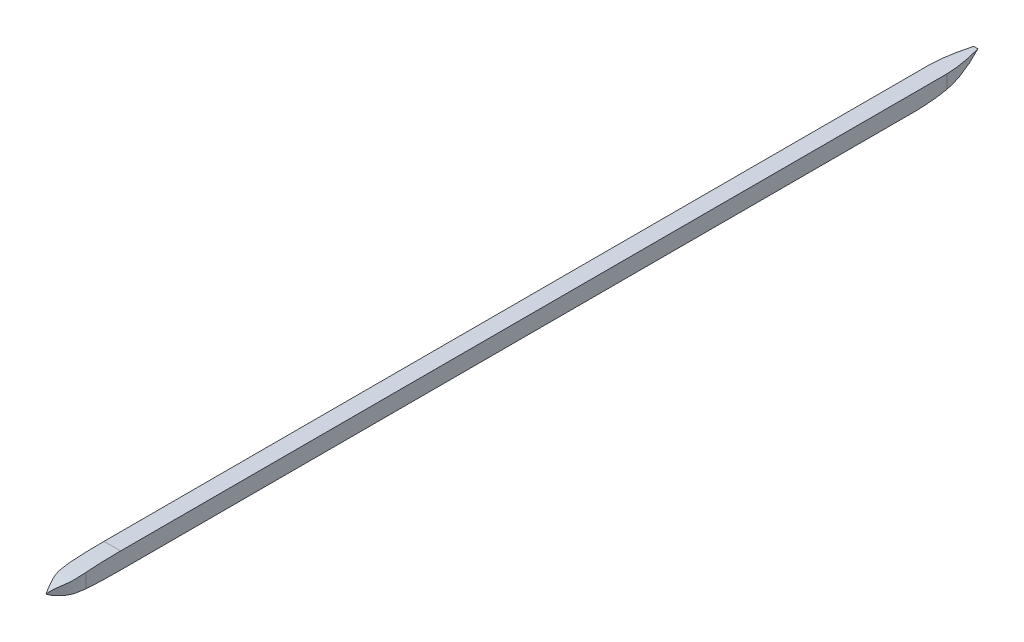
ISO-10303-21;
HEADER;
FILE_DESCRIPTION(('STEP AP214'),'2;1');
FILE_NAME('part.step','',(''),(''),'','','');
FILE_SCHEMA(('AUTOMOTIVE_DESIGN { 1 0 10303 214 1 1 1 1 }'));
ENDSEC;
DATA;
#1=APPLICATION_CONTEXT('core data for automotive mechanical design processes');
#2=APPLICATION_PROTOCOL_DEFINITION('international standard','automotive_design',2000,#1);
#3=PRODUCT_CONTEXT('',#1,'mechanical');
#4=PRODUCT('Part','Part','',(#3));
#5=PRODUCT_RELATED_PRODUCT_CATEGORY('part','',(#4));
#6=PRODUCT_DEFINITION_FORMATION('','',#4);
#7=PRODUCT_DEFINITION_CONTEXT('part definition',#1,'design');
#8=PRODUCT_DEFINITION('design','',#6,#7);
#9=PRODUCT_DEFINITION_SHAPE('','',#8);
#10=(LENGTH_UNIT() NAMED_UNIT(*) SI_UNIT(.MILLI.,.METRE.));
#11=(NAMED_UNIT(*) PLANE_ANGLE_UNIT() SI_UNIT($,.RADIAN.));
#12=(NAMED_UNIT(*) SI_UNIT($,.STERADIAN.) SOLID_ANGLE_UNIT());
#13=UNCERTAINTY_MEASURE_WITH_UNIT(LENGTH_MEASURE(1.E-05),#10,'distance_accuracy_value','');
#14=(GEOMETRIC_REPRESENTATION_CONTEXT(3) GLOBAL_UNCERTAINTY_ASSIGNED_CONTEXT((#13)) GLOBAL_UNIT_ASSIGNED_CONTEXT((#10,
#11,#12)) REPRESENTATION_CONTEXT('',''));
#15=CARTESIAN_POINT('',(0.,0.,0.));
#16=DIRECTION('',(0.,0.,1.));
#17=DIRECTION('',(1.,0.,0.));
#18=AXIS2_PLACEMENT_3D('',#15,#16,#17);
#19=CARTESIAN_POINT('',(6.35,-6.34999999999996,-355.6));
#20=DIRECTION('',(0.,1.,0.));
#21=DIRECTION('',(0.,0.,1.));
#22=AXIS2_PLACEMENT_3D('',#19,#20,#21);
#23=PLANE('',#22);
#24=DIRECTION('',(0.,0.,-1.));
#25=VECTOR('',#24,1.);
#26=CARTESIAN_POINT('',(-6.35,-6.34999999999996,-355.6));
#27=LINE('',#26,#25);
#28=CARTESIAN_POINT('',(-6.35,-6.35000000000005,304.874567486465));
#29=VERTEX_POINT('',#28);
#30=CARTESIAN_POINT('',(-6.35,-6.34999999999997,-303.146899187983));
#31=VERTEX_POINT('',#30);
#32=EDGE_CURVE('E264',#29,#31,#27,.T.);
#33=ORIENTED_EDGE('',*,*,#32,.T.);
#34=DIRECTION('',(1.,0.,0.));
#35=VECTOR('',#34,1.);
#36=CARTESIAN_POINT('',(-6.5940740807256,-6.34999999999997,-303.146899187983));
#37=LINE('',#36,#35);
#38=CARTESIAN_POINT('',(6.35,-6.34999999999997,-303.146899187983));
#39=VERTEX_POINT('',#38);
#40=EDGE_CURVE('E189',#31,#39,#37,.T.);
#41=ORIENTED_EDGE('',*,*,#40,.T.);
#42=DIRECTION('',(0.,0.,-1.));
#43=VECTOR('',#42,1.);
#44=CARTESIAN_POINT('',(6.35,-6.34999999999996,-355.6));
#45=LINE('',#44,#43);
#46=CARTESIAN_POINT('',(6.35,-6.35000000000005,304.874567486465));
#47=VERTEX_POINT('',#46);
#48=EDGE_CURVE('E137',#47,#39,#45,.T.);
#49=ORIENTED_EDGE('',*,*,#48,.F.);
#50=DIRECTION('',(1.,0.,0.));
#51=VECTOR('',#50,1.);
#52=CARTESIAN_POINT('',(-6.35,-6.35000000000005,304.874567486465));
#53=LINE('',#52,#51);
#54=EDGE_CURVE('E258',#29,#47,#53,.T.);
#55=ORIENTED_EDGE('',*,*,#54,.F.);
#56=EDGE_LOOP('',(#33,#41,#49,#55));
#57=FACE_BOUND('',#56,.T.);
#58=ADVANCED_FACE('F43',(#57),#23,.F.);
#59=CARTESIAN_POINT('',(6.35,6.35000000000004,-355.6));
#60=DIRECTION('',(0.,-1.,0.));
#61=DIRECTION('',(0.,0.,-1.));
#62=AXIS2_PLACEMENT_3D('',#59,#60,#61);
#63=PLANE('',#62);
#64=DIRECTION('',(-1.,0.,0.));
#65=VECTOR('',#64,1.);
#66=CARTESIAN_POINT('',(6.35,6.35000000000004,-355.6));
#67=LINE('',#66,#65);
#68=CARTESIAN_POINT('',(1.651,6.35000000000004,-355.6));
#69=VERTEX_POINT('',#68);
#70=CARTESIAN_POINT('',(-1.651,6.35000000000004,-355.6));
#71=VERTEX_POINT('',#70);
#72=EDGE_CURVE('E123',#69,#71,#67,.T.);
#73=ORIENTED_EDGE('',*,*,#72,.T.);
#74=CARTESIAN_POINT('',(-6.35,6.35000000000004,-310.113688271331));
#75=CARTESIAN_POINT('',(-6.35,6.35000000000004,-324.690959150844));
#76=CARTESIAN_POINT('',(-7.54306509066211,6.35000000000004,-333.607768993203));
#77=CARTESIAN_POINT('',(-1.651,6.35000000000004,-355.6));
#78=B_SPLINE_CURVE_WITH_KNOTS('',3,(#74,#75,#76,#77),.UNSPECIFIED.,.F.,.F.,(4,4),(0.,1.),.UNSPECIFIED.);
#79=CARTESIAN_POINT('',(-6.35,6.35000000000004,-327.361618801304));
#80=VERTEX_POINT('',#79);
#81=EDGE_CURVE('E68',#80,#71,#78,.T.);
#82=ORIENTED_EDGE('',*,*,#81,.F.);
#83=DIRECTION('',(0.,0.,1.));
#84=VECTOR('',#83,1.);
#85=CARTESIAN_POINT('',(-6.35,6.35000000000004,-355.6));
#86=LINE('',#85,#84);
#87=CARTESIAN_POINT('',(-6.35,6.34999999999996,304.874086049634));
#88=VERTEX_POINT('',#87);
#89=EDGE_CURVE('E46',#80,#88,#86,.T.);
#90=ORIENTED_EDGE('',*,*,#89,.T.);
#91=DIRECTION('',(1.,0.,0.));
#92=VECTOR('',#91,1.);
#93=CARTESIAN_POINT('',(-6.35,6.35000000000004,304.874086049634));
#94=LINE('',#93,#92);
#95=CARTESIAN_POINT('',(6.35,6.35000000000004,304.874086049634));
#96=VERTEX_POINT('',#95);
#97=EDGE_CURVE('E240',#88,#96,#94,.T.);
#98=ORIENTED_EDGE('',*,*,#97,.T.);
#99=DIRECTION('',(0.,0.,1.));
#100=VECTOR('',#99,1.);
#101=CARTESIAN_POINT('',(6.35,6.35000000000004,-355.6));
#102=LINE('',#101,#100);
#103=CARTESIAN_POINT('',(6.35,6.35000000000004,-327.361618801305));
#104=VERTEX_POINT('',#103);
#105=EDGE_CURVE('E125',#104,#96,#102,.T.);
#106=ORIENTED_EDGE('',*,*,#105,.F.);
#107=CARTESIAN_POINT('',(1.651,6.35000000000004,-355.6));
#108=CARTESIAN_POINT('',(7.54306509066212,6.35000000000004,-333.607768993203));
#109=CARTESIAN_POINT('',(6.35000000000001,6.35000000000004,-324.690959150844));
#110=CARTESIAN_POINT('',(6.35000000000001,6.35000000000004,-310.113688271331));
#111=B_SPLINE_CURVE_WITH_KNOTS('',3,(#107,#108,#109,#110),.UNSPECIFIED.,.F.,.F.,(4,4),(0.,1.),.UNSPECIFIED.);
#112=EDGE_CURVE('E112',#69,#104,#111,.T.);
#113=ORIENTED_EDGE('',*,*,#112,.F.);
#114=EDGE_LOOP('',(#73,#82,#90,#98,#106,#113));
#115=FACE_BOUND('',#114,.T.);
#116=ADVANCED_FACE('F122',(#115),#63,.F.);
#117=CARTESIAN_POINT('',(6.35,0.,0.));
#118=DIRECTION('',(-1.,0.,0.));
#119=DIRECTION('',(0.,0.,1.));
#120=AXIS2_PLACEMENT_3D('',#117,#118,#119);
#121=PLANE('',#120);
#122=ORIENTED_EDGE('',*,*,#48,.T.);
#123=CARTESIAN_POINT('',(6.35,6.35000000000004,-355.6));
#124=CARTESIAN_POINT('',(6.35,-6.5637243393672,-329.990285951322));
#125=CARTESIAN_POINT('',(6.35,-6.62904134635052,-313.323760361123));
#126=CARTESIAN_POINT('',(6.35,-6.35000000000005,-286.848717455997));
#127=B_SPLINE_CURVE_WITH_KNOTS('',3,(#123,#124,#125,#126),.UNSPECIFIED.,.F.,.F.,(4,4),(0.,1.),.UNSPECIFIED.);
#128=CARTESIAN_POINT('',(6.35,-3.90703152376039,-327.36161880128));
#129=VERTEX_POINT('',#128);
#130=EDGE_CURVE('E287',#129,#39,#127,.T.);
#131=ORIENTED_EDGE('',*,*,#130,.F.);
#132=DIRECTION('',(0.,1.,0.));
#133=VECTOR('',#132,1.);
#134=CARTESIAN_POINT('',(6.35,-6.35002499999997,-327.361618801304));
#135=LINE('',#134,#133);
#136=EDGE_CURVE('E60',#129,#104,#135,.T.);
#137=ORIENTED_EDGE('',*,*,#136,.T.);
#138=ORIENTED_EDGE('',*,*,#105,.T.);
#139=CARTESIAN_POINT('',(6.35,0.,355.6));
#140=CARTESIAN_POINT('',(6.35,6.35000000000004,345.591229217103));
#141=CARTESIAN_POINT('',(6.35,6.35000000000004,304.874086049634));
#142=B_SPLINE_CURVE_WITH_KNOTS('',2,(#139,#140,#141),.UNSPECIFIED.,.F.,.F.,(3,3),(0.,1.),.UNSPECIFIED.);
#143=CARTESIAN_POINT('',(6.35000000000001,5.42402896421739,331.493169104526));
#144=VERTEX_POINT('',#143);
#145=EDGE_CURVE('E229',#144,#96,#142,.T.);
#146=ORIENTED_EDGE('',*,*,#145,.F.);
#147=DIRECTION('',(0.,1.,0.));
#148=VECTOR('',#147,1.);
#149=CARTESIAN_POINT('',(6.35,-6.35000000000014,331.493169104527));
#150=LINE('',#149,#148);
#151=CARTESIAN_POINT('',(6.35,-5.51739729989977,331.493169104526));
#152=VERTEX_POINT('',#151);
#153=EDGE_CURVE('E230',#144,#152,#150,.F.);
#154=ORIENTED_EDGE('',*,*,#153,.T.);
#155=CARTESIAN_POINT('',(6.35,-6.35000000000005,304.874567486465));
#156=CARTESIAN_POINT('',(6.35,-6.35000000000006,348.097307303599));
#157=CARTESIAN_POINT('',(6.35,0.,355.6));
#158=B_SPLINE_CURVE_WITH_KNOTS('',2,(#155,#156,#157),.UNSPECIFIED.,.F.,.F.,(3,3),(0.,1.),.UNSPECIFIED.);
#159=EDGE_CURVE('E241',#47,#152,#158,.T.);
#160=ORIENTED_EDGE('',*,*,#159,.F.);
#161=EDGE_LOOP('',(#122,#131,#137,#138,#146,#154,#160));
#162=FACE_BOUND('',#161,.T.);
#163=ADVANCED_FACE('F218',(#162),#121,.F.);
#164=CARTESIAN_POINT('',(-6.35,0.,0.));
#165=DIRECTION('',(-1.,0.,0.));
#166=DIRECTION('',(0.,0.,1.));
#167=AXIS2_PLACEMENT_3D('',#164,#165,#166);
#168=PLANE('',#167);
#169=CARTESIAN_POINT('',(-6.35,0.,355.6));
#170=CARTESIAN_POINT('',(-6.35,6.35000000000004,345.591229217103));
#171=CARTESIAN_POINT('',(-6.35,6.35000000000004,304.874086049634));
#172=B_SPLINE_CURVE_WITH_KNOTS('',2,(#169,#170,#171),.UNSPECIFIED.,.F.,.F.,(3,3),(0.,1.),.UNSPECIFIED.);
#173=CARTESIAN_POINT('',(-6.35,5.42402896421737,331.493169104526));
#174=VERTEX_POINT('',#173);
#175=EDGE_CURVE('E228',#174,#88,#172,.T.);
#176=ORIENTED_EDGE('',*,*,#175,.T.);
#177=ORIENTED_EDGE('',*,*,#89,.F.);
#178=DIRECTION('',(0.,1.,0.));
#179=VECTOR('',#178,1.);
#180=CARTESIAN_POINT('',(-6.35,-6.35002499999997,-327.361618801304));
#181=LINE('',#180,#179);
#182=CARTESIAN_POINT('',(-6.35,-3.90703152375534,-327.361618801304));
#183=VERTEX_POINT('',#182);
#184=EDGE_CURVE('E289',#183,#80,#181,.T.);
#185=ORIENTED_EDGE('',*,*,#184,.F.);
#186=CARTESIAN_POINT('',(-6.35,6.35000000000004,-355.6));
#187=CARTESIAN_POINT('',(-6.35,-6.5637243393672,-329.990285951322));
#188=CARTESIAN_POINT('',(-6.35,-6.62904134635052,-313.323760361123));
#189=CARTESIAN_POINT('',(-6.35,-6.35000000000005,-286.848717455997));
#190=B_SPLINE_CURVE_WITH_KNOTS('',3,(#186,#187,#188,#189),.UNSPECIFIED.,.F.,.F.,(4,4),(0.,1.),.UNSPECIFIED.);
#191=EDGE_CURVE('E117',#31,#183,#190,.F.);
#192=ORIENTED_EDGE('',*,*,#191,.F.);
#193=ORIENTED_EDGE('',*,*,#32,.F.);
#194=CARTESIAN_POINT('',(-6.35,-6.35000000000005,304.874567486465));
#195=CARTESIAN_POINT('',(-6.35,-6.35000000000006,348.097307303599));
#196=CARTESIAN_POINT('',(-6.35,0.,355.6));
#197=B_SPLINE_CURVE_WITH_KNOTS('',2,(#194,#195,#196),.UNSPECIFIED.,.F.,.F.,(3,3),(0.,1.),.UNSPECIFIED.);
#198=CARTESIAN_POINT('',(-6.35,-5.51739729989977,331.493169104527));
#199=VERTEX_POINT('',#198);
#200=EDGE_CURVE('E221',#29,#199,#197,.T.);
#201=ORIENTED_EDGE('',*,*,#200,.T.);
#202=DIRECTION('',(0.,1.,0.));
#203=VECTOR('',#202,1.);
#204=CARTESIAN_POINT('',(-6.35,-6.35000000000014,331.493169104527));
#205=LINE('',#204,#203);
#206=EDGE_CURVE('E209',#174,#199,#205,.F.);
#207=ORIENTED_EDGE('',*,*,#206,.F.);
#208=EDGE_LOOP('',(#176,#177,#185,#192,#193,#201,#207));
#209=FACE_BOUND('',#208,.T.);
#210=ADVANCED_FACE('F216',(#209),#168,.T.);
#211=DIRECTION('',(1.,0.,0.));
#212=VECTOR('',#211,1.);
#213=SURFACE_OF_LINEAR_EXTRUSION('',#197,#212);
#214=ORIENTED_EDGE('',*,*,#159,.T.);
#215=CARTESIAN_POINT('',(6.35,-5.51739729989977,331.493169104526));
#216=CARTESIAN_POINT('',(6.34501941181997,-5.49566703571689,331.779400633108));
#217=CARTESIAN_POINT('',(6.3394376464141,-5.47333569362236,332.065578077955));
#218=CARTESIAN_POINT('',(6.32674042619024,-5.42731500821561,332.638945292702));
#219=CARTESIAN_POINT('',(6.31961890924752,-5.40362057699498,332.926134518726));
#220=CARTESIAN_POINT('',(6.30352137627247,-5.35481692300524,333.501223766158));
#221=CARTESIAN_POINT('',(6.29453977655446,-5.32970360995034,333.789123287527));
#222=CARTESIAN_POINT('',(6.27431356367509,-5.27800235204223,334.365327069807));
#223=CARTESIAN_POINT('',(6.26306419727728,-5.25141139628948,334.653630896291));
#224=CARTESIAN_POINT('',(6.23781076530202,-5.19669342800515,335.230334611942));
#225=CARTESIAN_POINT('',(6.22380330752992,-5.1685645550651,335.518734178367));
#226=CARTESIAN_POINT('',(6.19243752135768,-5.11070724666675,336.095317004049));
#227=CARTESIAN_POINT('',(6.17507777557032,-5.08097813845844,336.383500119863));
#228=CARTESIAN_POINT('',(6.13647005751908,-5.02013405665238,336.956702931641));
#229=CARTESIAN_POINT('',(6.11526029324599,-4.98903479463892,337.241726832915));
#230=CARTESIAN_POINT('',(6.0680266313128,-4.92513076007844,337.810983105218));
#231=CARTESIAN_POINT('',(6.04200616085372,-4.89232721357002,338.095215894431));
#232=CARTESIAN_POINT('',(5.98420954864191,-4.82494529196914,338.662577891978));
#233=CARTESIAN_POINT('',(5.95243964910158,-4.79036887059984,338.945707960291));
#234=CARTESIAN_POINT('',(5.88211291974021,-4.71937047741731,339.510540060058));
#235=CARTESIAN_POINT('',(5.84356452430799,-4.68295083874147,339.792243423733));
#236=CARTESIAN_POINT('',(5.75862875978531,-4.60819286744104,340.353893906118));
#237=CARTESIAN_POINT('',(5.7122502006125,-4.56985672487339,340.633842635885));
#238=CARTESIAN_POINT('',(5.61071542856606,-4.4911888051765,341.191660646313));
#239=CARTESIAN_POINT('',(5.55556542367025,-4.45085845325428,341.469531253211));
#240=CARTESIAN_POINT('',(5.42252728414517,-4.35894050865735,342.084267655718));
#241=CARTESIAN_POINT('',(5.34230872833862,-4.30683926653376,342.420556956706));
#242=CARTESIAN_POINT('',(5.16750739143722,-4.19934880663565,343.089136836009));
#243=CARTESIAN_POINT('',(5.07291314027144,-4.1439569850654,343.421423990548));
#244=CARTESIAN_POINT('',(4.87048191623376,-4.029650466069,344.081711005986));
#245=CARTESIAN_POINT('',(4.76263062893235,-3.97073199654164,344.409705801923));
#246=CARTESIAN_POINT('',(4.5359198435478,-3.84902727098814,345.061474539129));
#247=CARTESIAN_POINT('',(4.41704992197321,-3.78623737182769,345.385244146298));
#248=CARTESIAN_POINT('',(4.1711028983125,-3.65632883161627,346.028816767172));
#249=CARTESIAN_POINT('',(4.04402435959744,-3.58920943284196,346.348619074805));
#250=CARTESIAN_POINT('',(3.78488425277986,-3.45029964052903,346.983457559123));
#251=CARTESIAN_POINT('',(3.65284702744092,-3.37853106188168,347.2985085017));
#252=CARTESIAN_POINT('',(3.38556566933375,-3.22931189005307,347.925607189529));
#253=CARTESIAN_POINT('',(3.25032392869389,-3.15186545017099,348.23765694479));
#254=CARTESIAN_POINT('',(2.97833933630313,-2.99031025961228,348.859192516535));
#255=CARTESIAN_POINT('',(2.84159720595086,-2.90620459938999,349.168679449581));
#256=CARTESIAN_POINT('',(2.56790406694604,-2.73012066157269,349.785279339613));
#257=CARTESIAN_POINT('',(2.43095308190468,-2.63814321721892,350.09239254412));
#258=CARTESIAN_POINT('',(2.15780984242889,-2.44477386791091,350.704220081783));
#259=CARTESIAN_POINT('',(2.02161802625344,-2.34337702323571,351.008933064317));
#260=CARTESIAN_POINT('',(1.80219944618605,-2.16980028064334,351.500431605027));
#261=CARTESIAN_POINT('',(1.7184350693275,-2.10108669862854,351.688202169213));
#262=CARTESIAN_POINT('',(1.55180299108684,-1.95871581207439,352.062237775176));
#263=CARTESIAN_POINT('',(1.46893517816947,-1.88505913087768,352.248503003475));
#264=CARTESIAN_POINT('',(1.30438048127617,-1.73216152999763,352.619061270261));
#265=CARTESIAN_POINT('',(1.22269271205257,-1.65292508972788,352.803355756971));
#266=CARTESIAN_POINT('',(1.06078214924094,-1.48805872222071,353.169443308005));
#267=CARTESIAN_POINT('',(0.980557823733577,-1.40243602237226,353.351238932342));
#268=CARTESIAN_POINT('',(0.821419136436688,-1.22324377665218,353.712744957095));
#269=CARTESIAN_POINT('',(0.742513031296244,-1.1296376472852,353.89244093794));
#270=CARTESIAN_POINT('',(0.586811524829311,-0.933486175791506,354.247956543366));
#271=CARTESIAN_POINT('',(0.510016730512141,-0.830938297510072,354.423775050345));
#272=CARTESIAN_POINT('',(0.39680612102096,-0.669075648241098,354.683665038529));
#273=CARTESIAN_POINT('',(0.359356651713075,-0.613711445498773,354.76975436405));
#274=CARTESIAN_POINT('',(0.285252977767262,-0.500080243155258,354.940337000024));
#275=CARTESIAN_POINT('',(0.248598692255059,-0.441813540758879,355.02483047267));
#276=CARTESIAN_POINT('',(0.175978836432763,-0.321735952209654,355.1924575778));
#277=CARTESIAN_POINT('',(0.140018863559338,-0.259905534024054,355.275579703128));
#278=CARTESIAN_POINT('',(0.069165840853114,-0.132691880079055,355.43957820109));
#279=CARTESIAN_POINT('',(0.0342731856729687,-0.0673073543829119,355.520453742034));
#280=CARTESIAN_POINT('',(0.,0.,355.6));
#281=B_SPLINE_CURVE_WITH_KNOTS('',3,(#215,#216,#217,#218,#219,#220,#221,#222,#223,#224,#225,
#226,#227,#228,#229,#230,#231,#232,#233,#234,#235,#236,#237,#238,#239,#240,#241,#242,#243,#244,
#245,#246,#247,#248,#249,#250,#251,#252,#253,#254,#255,#256,#257,#258,#259,#260,#261,#262,#263,
#264,#265,#266,#267,#268,#269,#270,#271,#272,#273,#274,#275,#276,#277,#278,#279,#280),
.UNSPECIFIED.,.F.,.F.,(4,2,2,2,2,2,2,2,2,2,2,2,2,2,2,2,2,2,2,2,2,2,2,2,2,2,2,2,2,2,2,2,4),(0.,
0.861296976087886,1.72604878593227,2.59343508612325,3.46265869167864,4.33295811501684,
5.20362632018559,6.06608447498515,6.92793055609931,7.78884647559469,8.64869865309385,
9.50758975861512,10.3658756683023,11.4144187040633,12.4638027861805,13.5143300731295,
14.5658614901908,15.6175774419992,16.6646732234281,17.7110105634311,18.7568651270246,
19.8026091217992,20.848904655205,21.4992083601367,22.1494302129606,22.7991358931442,
23.4481171374246,24.1002509891215,24.7525704114425,25.0794998488773,25.4063958785323,
25.7352952804856,26.0643148615889),.UNSPECIFIED.);
#282=CARTESIAN_POINT('',(0.,0.,355.6));
#283=VERTEX_POINT('',#282);
#284=EDGE_CURVE('E435',#152,#283,#281,.T.);
#285=ORIENTED_EDGE('',*,*,#284,.T.);
#286=CARTESIAN_POINT('',(0.,0.,355.6));
#287=CARTESIAN_POINT('',(-0.0348822737711476,-0.0685026073062853,355.519040037103));
#288=CARTESIAN_POINT('',(-0.0704057868771771,-0.135013817104099,355.436704209841));
#289=CARTESIAN_POINT('',(-0.142555452594564,-0.264358634616264,355.269712602004));
#290=CARTESIAN_POINT('',(-0.179181180221125,-0.327193632951305,355.185057716699));
#291=CARTESIAN_POINT('',(-0.253059664915068,-0.449010973092161,355.014542056194));
#292=CARTESIAN_POINT('',(-0.29030420101512,-0.508022063078878,354.928698166225));
#293=CARTESIAN_POINT('',(-0.365606887927501,-0.623067567769994,354.755379679119));
#294=CARTESIAN_POINT('',(-0.403665124395173,-0.679101666911982,354.667904910432));
#295=CARTESIAN_POINT('',(-0.518582013112921,-0.842675447308451,354.404145468319));
#296=CARTESIAN_POINT('',(-0.596491410631273,-0.946187801715911,354.22581334513));
#297=CARTESIAN_POINT('',(-0.754360536289568,-1.14398283172217,353.865436323165));
#298=CARTESIAN_POINT('',(-0.834317068563794,-1.23827890421536,353.68339729267));
#299=CARTESIAN_POINT('',(-0.995949120677389,-1.41915820942396,353.316332708234));
#300=CARTESIAN_POINT('',(-1.07762437412059,-1.50574262669249,353.131307618145));
#301=CARTESIAN_POINT('',(-1.24212172653643,-1.67204272785623,352.759493939066));
#302=CARTESIAN_POINT('',(-1.32493961525165,-1.75177837288749,352.572712366637));
#303=CARTESIAN_POINT('',(-1.49181069726507,-1.90564511592153,352.197057710312));
#304=CARTESIAN_POINT('',(-1.57586543859921,-1.97976832181782,352.008182094219));
#305=CARTESIAN_POINT('',(-1.74497646346322,-2.12309582638136,351.628683999422));
#306=CARTESIAN_POINT('',(-1.83003394301854,-2.19229336837106,351.438059511259));
#307=CARTESIAN_POINT('',(-2.00090737456171,-2.32632267107986,351.055356315023));
#308=CARTESIAN_POINT('',(-2.08672403589387,-2.39114971902775,350.863276277966));
#309=CARTESIAN_POINT('',(-2.25885019780126,-2.5168909050246,350.477911157061));
#310=CARTESIAN_POINT('',(-2.34515996653792,-2.57780263760923,350.284625410953));
#311=CARTESIAN_POINT('',(-2.57326271634312,-2.73393972434544,349.773097970851));
#312=CARTESIAN_POINT('',(-2.71522676625428,-2.82618769783026,349.454022483914));
#313=CARTESIAN_POINT('',(-2.99836916450861,-3.00269701133292,348.813500937626));
#314=CARTESIAN_POINT('',(-3.13954780219208,-3.0869615050545,348.492055868868));
#315=CARTESIAN_POINT('',(-3.41944871114405,-3.24871055049701,347.84664960229));
#316=CARTESIAN_POINT('',(-3.55817243714849,-3.32619923260597,347.522690070237));
#317=CARTESIAN_POINT('',(-3.83099366851144,-3.47537848890295,346.871860420267));
#318=CARTESIAN_POINT('',(-3.96509528079444,-3.54707429064603,346.544993228813));
#319=CARTESIAN_POINT('',(-4.22602132402697,-3.68548040923897,345.887712337968));
#320=CARTESIAN_POINT('',(-4.35285320068362,-3.75219584898461,345.557302694068));
#321=CARTESIAN_POINT('',(-4.59633167429965,-3.88130812190022,344.892169144471));
#322=CARTESIAN_POINT('',(-4.71298559788795,-3.94370805477792,344.557448544583));
#323=CARTESIAN_POINT('',(-4.93373165250242,-4.06486672846724,343.882128662565));
#324=CARTESIAN_POINT('',(-5.03778725419853,-4.12361465129905,343.541515410897));
#325=CARTESIAN_POINT('',(-5.23108629796458,-4.23759237372824,342.855343625374));
#326=CARTESIAN_POINT('',(-5.32032296091064,-4.29282055609275,342.509782906319));
#327=CARTESIAN_POINT('',(-5.48352331597224,-4.39993762793184,341.814337731936));
#328=CARTESIAN_POINT('',(-5.55747745133265,-4.45182441402748,341.464450715256));
#329=CARTESIAN_POINT('',(-5.69106799760103,-4.55239015207325,340.761232266753));
#330=CARTESIAN_POINT('',(-5.75069319355093,-4.60106656985736,340.407898360728));
#331=CARTESIAN_POINT('',(-5.85744956594344,-4.69532212273168,339.69880684651));
#332=CARTESIAN_POINT('',(-5.90457535291164,-4.74089991548338,339.343048260439));
#333=CARTESIAN_POINT('',(-5.98844727753071,-4.82906554021706,338.630164363155));
#334=CARTESIAN_POINT('',(-6.02519918941397,-4.87165502556951,338.273039924843));
#335=CARTESIAN_POINT('',(-6.07721800345771,-4.9373871523439,337.70231123042));
#336=CARTESIAN_POINT('',(-6.09516444092902,-4.9614315558152,337.489046941476));
#337=CARTESIAN_POINT('',(-6.12847844112074,-5.00855076349169,337.062340142616));
#338=CARTESIAN_POINT('',(-6.1438475462101,-5.03162614135401,336.848897816664));
#339=CARTESIAN_POINT('',(-6.17235689107598,-5.07684948092656,336.42185064773));
#340=CARTESIAN_POINT('',(-6.18549797948393,-5.09899779331585,336.208245897896));
#341=CARTESIAN_POINT('',(-6.20985533702255,-5.14240667918344,335.780883496986));
#342=CARTESIAN_POINT('',(-6.22107201621648,-5.16366744105324,335.567125888255));
#343=CARTESIAN_POINT('',(-6.24184404516502,-5.20533827576131,335.139465473592));
#344=CARTESIAN_POINT('',(-6.25139953051833,-5.22574841792984,334.925562680942));
#345=CARTESIAN_POINT('',(-6.26908752595585,-5.26577842098377,334.497342186842));
#346=CARTESIAN_POINT('',(-6.27721815870837,-5.28539721341849,334.283024308623));
#347=CARTESIAN_POINT('',(-6.29223728013324,-5.32384895334664,333.854256257035));
#348=CARTESIAN_POINT('',(-6.29912566134083,-5.34268183274405,333.639806073829));
#349=CARTESIAN_POINT('',(-6.31182818923068,-5.37959171615761,333.210783029148));
#350=CARTESIAN_POINT('',(-6.3176422060716,-5.39766862860807,332.996210155984));
#351=CARTESIAN_POINT('',(-6.3283415706137,-5.43309482997493,332.566950733694));
#352=CARTESIAN_POINT('',(-6.33322678601982,-5.45044401496262,332.352264172735));
#353=CARTESIAN_POINT('',(-6.34218935295179,-5.48444096418453,331.922785159493));
#354=CARTESIAN_POINT('',(-6.34626657946794,-5.5010886195669,331.707992695971));
#355=CARTESIAN_POINT('',(-6.35,-5.51739729989977,331.493169104527));
#356=B_SPLINE_CURVE_WITH_KNOTS('',3,(#286,#287,#288,#289,#290,#291,#292,#293,#294,#295,#296,
#297,#298,#299,#300,#301,#302,#303,#304,#305,#306,#307,#308,#309,#310,#311,#312,#313,#314,#315,
#316,#317,#318,#319,#320,#321,#322,#323,#324,#325,#326,#327,#328,#329,#330,#331,#332,#333,#334,
#335,#336,#337,#338,#339,#340,#341,#342,#343,#344,#345,#346,#347,#348,#349,#350,#351,#352,#353,
#354,#355),.UNSPECIFIED.,.F.,.F.,(4,2,2,2,2,2,2,2,2,2,2,2,2,2,2,2,2,2,2,2,2,2,2,2,2,2,2,2,2,2,2,
2,2,2,4),(0.,0.3348627044157,0.669597908392048,1.00142260816478,1.33328241161789,
1.99423433309198,2.6542107341162,3.31408558362545,3.97196685761278,4.63075668352057,
5.29043343851558,5.95081051695959,6.61158951012718,7.69509523469647,8.77817114303453,
9.86058216102167,10.9420052296218,12.0223001437961,13.1018108755639,14.1843803119123,
15.2674436281129,16.351182189718,17.4357662280347,18.5208171580495,19.6052629384036,
20.2513408020778,20.897030638861,21.5424739830004,22.1877796213941,22.8330325605023,
23.4791293709836,24.1252820472578,24.771512762734,25.4178354560993,26.0642580687053),.UNSPECIFIED.);
#357=EDGE_CURVE('E198',#283,#199,#356,.T.);
#358=ORIENTED_EDGE('',*,*,#357,.T.);
#359=ORIENTED_EDGE('',*,*,#200,.F.);
#360=ORIENTED_EDGE('',*,*,#54,.T.);
#361=EDGE_LOOP('',(#214,#285,#358,#359,#360));
#362=FACE_BOUND('',#361,.T.);
#363=ADVANCED_FACE('F211',(#362),#213,.F.);
#364=DIRECTION('',(1.,0.,0.));
#365=VECTOR('',#364,1.);
#366=SURFACE_OF_LINEAR_EXTRUSION('',#172,#365);
#367=CARTESIAN_POINT('',(-6.35,5.42402896421737,331.493169104527));
#368=CARTESIAN_POINT('',(-6.34635265530441,5.40646890812681,331.703108486857));
#369=CARTESIAN_POINT('',(-6.3423753015807,5.38856136066117,331.913012941238));
#370=CARTESIAN_POINT('',(-6.33365096526616,5.35202689000044,332.332744924706));
#371=CARTESIAN_POINT('',(-6.32890397623845,5.33339996078978,332.542572453135));
#372=CARTESIAN_POINT('',(-6.31331071176491,5.27628116002574,333.173279733068));
#373=CARTESIAN_POINT('',(-6.30113427912018,5.23666444824226,333.594027091271));
#374=CARTESIAN_POINT('',(-6.27205765488602,5.15414823788567,334.435840373185));
#375=CARTESIAN_POINT('',(-6.255148629437,5.11124271022086,334.856905409728));
#376=CARTESIAN_POINT('',(-6.21503444007646,5.02195249167601,335.698649223995));
#377=CARTESIAN_POINT('',(-6.19182525586153,4.97556559296044,336.119327582384));
#378=CARTESIAN_POINT('',(-6.13703757894969,4.87910677573626,336.959567778448));
#379=CARTESIAN_POINT('',(-6.10546229895075,4.82903627710181,337.379129982406));
#380=CARTESIAN_POINT('',(-6.03127500927084,4.72499402008475,338.216383665457));
#381=CARTESIAN_POINT('',(-5.98867431189804,4.67102630101192,338.634076618187));
#382=CARTESIAN_POINT('',(-5.89028928398645,4.56017499004471,339.457810148265));
#383=CARTESIAN_POINT('',(-5.83482466028794,4.50338486071891,339.863900729402));
#384=CARTESIAN_POINT('',(-5.70710470237441,4.38573571867242,340.672080985356));
#385=CARTESIAN_POINT('',(-5.6348822000707,4.32488482572696,341.07417690058));
#386=CARTESIAN_POINT('',(-5.51214872439953,4.23043760980146,341.673529803278));
#387=CARTESIAN_POINT('',(-5.46887425156946,4.19845110175751,341.872539127372));
#388=CARTESIAN_POINT('',(-5.37738889418152,4.13339021935669,342.269244987363));
#389=CARTESIAN_POINT('',(-5.32917802012571,4.10031584731433,342.466941526054));
#390=CARTESIAN_POINT('',(-5.22783343257568,4.03307265998477,342.860801193466));
#391=CARTESIAN_POINT('',(-5.17470152047857,3.99890424815555,343.056964855023));
#392=CARTESIAN_POINT('',(-5.06366100994291,3.92943418760664,343.447732103456));
#393=CARTESIAN_POINT('',(-5.00575240449968,3.89413253722518,343.642335688044));
#394=CARTESIAN_POINT('',(-4.88543090636315,3.82233427291881,344.030062161522));
#395=CARTESIAN_POINT('',(-4.82301514441274,3.78583690602118,344.22318401906));
#396=CARTESIAN_POINT('',(-4.69414643717123,3.71161312060301,344.607840903683));
#397=CARTESIAN_POINT('',(-4.62769334473321,3.67388665730938,344.799375872642));
#398=CARTESIAN_POINT('',(-4.4229611789273,3.5587122960149,345.371947285735));
#399=CARTESIAN_POINT('',(-4.27938707834835,3.47931497304436,345.750703517824));
#400=CARTESIAN_POINT('',(-4.02308155366966,3.33706298396398,346.400330908056));
#401=CARTESIAN_POINT('',(-3.9126311217556,3.27560991881586,346.672425101826));
#402=CARTESIAN_POINT('',(-3.68811042057252,3.14914789149892,347.214450952128));
#403=CARTESIAN_POINT('',(-3.57403837832267,3.08413717603006,347.484381465834));
#404=CARTESIAN_POINT('',(-3.34361813529949,2.95014162254861,348.022351453436));
#405=CARTESIAN_POINT('',(-3.2272694149624,2.8811558702344,348.290390476227));
#406=CARTESIAN_POINT('',(-2.99339437409225,2.73873572015778,348.824737620831));
#407=CARTESIAN_POINT('',(-2.87586816431867,2.66530173759538,349.091045901631));
#408=CARTESIAN_POINT('',(-2.64051136929195,2.51344516864535,349.621972548589));
#409=CARTESIAN_POINT('',(-2.52268091949592,2.43502452463718,349.886591529093));
#410=CARTESIAN_POINT('',(-2.28740043368106,2.27256699693505,350.414075897908));
#411=CARTESIAN_POINT('',(-2.16995021601791,2.18853341210546,350.676942218101));
#412=CARTESIAN_POINT('',(-1.9334660075075,2.01223880597868,351.206367553842));
#413=CARTESIAN_POINT('',(-1.81444979863346,1.91984313830138,351.47288984662));
#414=CARTESIAN_POINT('',(-1.57781421808361,1.72742858161917,352.003728447712));
#415=CARTESIAN_POINT('',(-1.46019454172486,1.62741139209304,352.26804523332));
#416=CARTESIAN_POINT('',(-1.22676759223885,1.41855990138685,352.794040795791));
#417=CARTESIAN_POINT('',(-1.11096055226059,1.30972447690873,353.055719231784));
#418=CARTESIAN_POINT('',(-0.881542207495579,1.08171204915032,353.575875731171));
#419=CARTESIAN_POINT('',(-0.76793295408217,0.962525905099892,353.834350730655));
#420=CARTESIAN_POINT('',(-0.599549987926683,0.774565009980285,354.21889798328));
#421=CARTESIAN_POINT('',(-0.543694030219825,0.710297203309487,354.346706589643));
#422=CARTESIAN_POINT('',(-0.432795336128999,0.578462180988557,354.600962887496));
#423=CARTESIAN_POINT('',(-0.377752557496672,0.510895137539608,354.727410649596));
#424=CARTESIAN_POINT('',(-0.268305422514895,0.371817390873271,354.979346720693));
#425=CARTESIAN_POINT('',(-0.213905606444875,0.300288735351287,355.104827123412));
#426=CARTESIAN_POINT('',(-0.106141621628548,0.153230760545715,355.353906753545));
#427=CARTESIAN_POINT('',(-0.052777647543813,0.077700699051908,355.477505626448));
#428=CARTESIAN_POINT('',(0.,0.,355.6));
#429=B_SPLINE_CURVE_WITH_KNOTS('',3,(#367,#368,#369,#370,#371,#372,#373,#374,#375,#376,#377,
#378,#379,#380,#381,#382,#383,#384,#385,#386,#387,#388,#389,#390,#391,#392,#393,#394,#395,#396,
#397,#398,#399,#400,#401,#402,#403,#404,#405,#406,#407,#408,#409,#410,#411,#412,#413,#414,#415,
#416,#417,#418,#419,#420,#421,#422,#423,#424,#425,#426,#427,#428),.UNSPECIFIED.,.F.,.F.,(4,2,2,
2,2,2,2,2,2,2,2,2,2,2,2,2,2,2,2,2,2,2,2,2,2,2,2,2,2,2,4),(0.,0.632111123096682,1.26422753314977,
2.53254609033593,3.80324806404032,5.0747628213661,6.34579000512661,7.61551822308399,
8.85655075151193,10.0951720874264,10.7135852195739,11.3319970360912,11.9501833645636,
12.5683705995771,13.1869549023305,13.8055617639114,15.0435629583771,15.9435739783987,
16.8440326125975,17.7446991952881,18.6452818384718,19.5455158148712,20.4452252794097,
21.3636243720382,22.2818192721063,23.2001313195431,24.1192627437027,24.5799520418051,
25.0406173202249,25.503575101783,25.9666190588849),.UNSPECIFIED.);
#430=EDGE_CURVE('E130',#174,#283,#429,.T.);
#431=ORIENTED_EDGE('',*,*,#430,.T.);
#432=CARTESIAN_POINT('',(0.,0.,355.6));
#433=CARTESIAN_POINT('',(0.0563841216987971,0.0830071350636068,355.469134829071));
#434=CARTESIAN_POINT('',(0.113436080703808,0.16353916126357,355.337012664095));
#435=CARTESIAN_POINT('',(0.22871115808274,0.320061748065179,355.070647508073));
#436=CARTESIAN_POINT('',(0.286934017756541,0.39605329742617,354.936404986877));
#437=CARTESIAN_POINT('',(0.404082818037591,0.54352625970117,354.666890149923));
#438=CARTESIAN_POINT('',(0.463003009192217,0.615030509352402,354.53162778531));
#439=CARTESIAN_POINT('',(0.581749005964675,0.754344900075908,354.259600095843));
#440=CARTESIAN_POINT('',(0.641574866860133,0.822154814493026,354.12283467939));
#441=CARTESIAN_POINT('',(0.821925803664011,1.02016746367005,353.711382227565));
#442=CARTESIAN_POINT('',(0.943646623735585,1.14535375314968,353.43479736594));
#443=CARTESIAN_POINT('',(1.18946630400873,1.38428531518131,352.878212379835));
#444=CARTESIAN_POINT('',(1.31356258766521,1.49804223079026,352.598216063518));
#445=CARTESIAN_POINT('',(1.5636726239314,1.7158969109821,352.035422157752));
#446=CARTESIAN_POINT('',(1.68968601671486,1.81999646276475,351.752625097374));
#447=CARTESIAN_POINT('',(1.94311841004139,2.0199105064164,351.184679417174));
#448=CARTESIAN_POINT('',(2.07053769531563,2.115723283925,350.899530324067));
#449=CARTESIAN_POINT('',(2.32513696846282,2.29941069632022,350.329486704334));
#450=CARTESIAN_POINT('',(2.45231106439212,2.38734144258422,350.04460755561));
#451=CARTESIAN_POINT('',(2.70675379800251,2.5570444777547,349.472815758435));
#452=CARTESIAN_POINT('',(2.83402244033173,2.63881247250847,349.185901841729));
#453=CARTESIAN_POINT('',(3.08768731494721,2.79692248783155,348.610012312264));
#454=CARTESIAN_POINT('',(3.21408305758207,2.87326165609368,348.321035702225));
#455=CARTESIAN_POINT('',(3.46474258236908,3.02114268712491,347.740840971002));
#456=CARTESIAN_POINT('',(3.58900578525008,3.09268326131211,347.449622270961));
#457=CARTESIAN_POINT('',(3.83380466399902,3.23151813230445,346.864596915405));
#458=CARTESIAN_POINT('',(3.95434020185595,3.29881227198769,346.570790164587));
#459=CARTESIAN_POINT('',(4.18976787978044,3.42963836875918,345.980093047108));
#460=CARTESIAN_POINT('',(4.30466014997338,3.49317041260272,345.68320275174));
#461=CARTESIAN_POINT('',(4.54910277871457,3.62938777373294,345.025406788023));
#462=CARTESIAN_POINT('',(4.67691991762604,3.70132652429962,344.663695053001));
#463=CARTESIAN_POINT('',(4.91761484209756,3.84082284388541,343.934713459396));
#464=CARTESIAN_POINT('',(5.03050168808043,3.90838305719836,343.567447123823));
#465=CARTESIAN_POINT('',(5.23889402847333,4.03941921517519,342.827558211661));
#466=CARTESIAN_POINT('',(5.33441146689285,4.10289794688997,342.454939507306));
#467=CARTESIAN_POINT('',(5.5076441823981,4.22595277416795,341.705074080021));
#468=CARTESIAN_POINT('',(5.58536434489491,4.28552993751056,341.327828657171));
#469=CARTESIAN_POINT('',(5.72441083688705,4.40089403299917,340.569862370136));
#470=CARTESIAN_POINT('',(5.78574022182352,4.45668167011097,340.189142167397));
#471=CARTESIAN_POINT('',(5.89442980260177,4.56455292940767,339.425626759084));
#472=CARTESIAN_POINT('',(5.94180405418857,4.61664023818369,339.042834039572));
#473=CARTESIAN_POINT('',(6.0253812397117,4.71737345771206,338.2753354516));
#474=CARTESIAN_POINT('',(6.06157646041191,4.76601697458124,337.890628447477));
#475=CARTESIAN_POINT('',(6.12520690934453,4.86004653766585,337.119833527734));
#476=CARTESIAN_POINT('',(6.15263592996912,4.90543025796925,336.733744828465));
#477=CARTESIAN_POINT('',(6.20071179396308,4.99311287312892,335.960687312763));
#478=CARTESIAN_POINT('',(6.22135656535308,5.03541082249619,335.573718263727));
#479=CARTESIAN_POINT('',(6.25742381785942,5.11708509460292,334.799369573811));
#480=CARTESIAN_POINT('',(6.2728480990103,5.15646242071427,334.411990120748));
#481=CARTESIAN_POINT('',(6.29113787183058,5.20827131584514,333.883771402254));
#482=CARTESIAN_POINT('',(6.29574370004806,5.2218862307887,333.743104551492));
#483=CARTESIAN_POINT('',(6.30447164645188,5.24876098018829,333.461768014928));
#484=CARTESIAN_POINT('',(6.30859392185054,5.26202092896251,333.321098345001));
#485=CARTESIAN_POINT('',(6.31640024826658,5.28819621501117,333.0397377582));
#486=CARTESIAN_POINT('',(6.32008436965354,5.30111160736383,332.899046848381));
#487=CARTESIAN_POINT('',(6.32704893970279,5.32658750273488,332.617847866542));
#488=CARTESIAN_POINT('',(6.33033001886485,5.33914853575351,332.477339858128));
#489=CARTESIAN_POINT('',(6.33653170691109,5.36394648006259,332.196263913085));
#490=CARTESIAN_POINT('',(6.33945225609446,5.37618333740941,332.055695970388));
#491=CARTESIAN_POINT('',(6.3449649055371,5.40034188084673,331.774480242423));
#492=CARTESIAN_POINT('',(6.34755689811632,5.41226346260206,331.633832446075));
#493=CARTESIAN_POINT('',(6.35,5.42402896421739,331.493169104526));
#494=B_SPLINE_CURVE_WITH_KNOTS('',3,(#432,#433,#434,#435,#436,#437,#438,#439,#440,#441,#442,
#443,#444,#445,#446,#447,#448,#449,#450,#451,#452,#453,#454,#455,#456,#457,#458,#459,#460,#461,
#462,#463,#464,#465,#466,#467,#468,#469,#470,#471,#472,#473,#474,#475,#476,#477,#478,#479,#480,
#481,#482,#483,#484,#485,#486,#487,#488,#489,#490,#491,#492,#493),.UNSPECIFIED.,.F.,.F.,(4,2,2,
2,2,2,2,2,2,2,2,2,2,2,2,2,2,2,2,2,2,2,2,2,2,2,2,2,2,2,4),(0.,0.494673699916907,0.98923928136839,
1.48104028634255,1.97287143043189,2.95382897644035,3.93377687127375,4.91354305285605,
5.89351144515329,6.86583256841188,7.83882505051093,8.81232502301733,9.786085374599,
10.759881735089,11.7336556307293,12.9043184334674,14.0742675295723,15.2434090468552,
16.4122292451781,17.5808314089262,18.7482524888796,19.9164772683237,21.0855274789971,
22.2549343985008,23.4239376926176,23.8481347374339,24.2721934831232,24.6961840307526,
25.1195026249208,25.5428912234244,25.9664182250731),.UNSPECIFIED.);
#495=EDGE_CURVE('E135',#283,#144,#494,.T.);
#496=ORIENTED_EDGE('',*,*,#495,.T.);
#497=ORIENTED_EDGE('',*,*,#145,.T.);
#498=ORIENTED_EDGE('',*,*,#97,.F.);
#499=ORIENTED_EDGE('',*,*,#175,.F.);
#500=EDGE_LOOP('',(#431,#496,#497,#498,#499));
#501=FACE_BOUND('',#500,.T.);
#502=ADVANCED_FACE('F172',(#501),#366,.F.);
#503=CARTESIAN_POINT('',(0.,-6.35000000000014,355.6));
#504=CARTESIAN_POINT('',(-7.32629632290238,-6.35000000000014,338.596228196123));
#505=CARTESIAN_POINT('',(-6.35,-6.35000000000014,345.744640535754));
#506=CARTESIAN_POINT('',(-6.35,-6.35000000000014,304.874086049634));
#507=B_SPLINE_CURVE_WITH_KNOTS('',3,(#503,#504,#505,#506),.UNSPECIFIED.,.F.,.F.,(4,4),(0.,1.),.UNSPECIFIED.);
#508=DIRECTION('',(0.,1.,0.));
#509=VECTOR('',#508,1.);
#510=SURFACE_OF_LINEAR_EXTRUSION('',#507,#509);
#511=ORIENTED_EDGE('',*,*,#206,.T.);
#512=ORIENTED_EDGE('',*,*,#357,.F.);
#513=ORIENTED_EDGE('',*,*,#430,.F.);
#514=EDGE_LOOP('',(#511,#512,#513));
#515=FACE_BOUND('',#514,.T.);
#516=ADVANCED_FACE('F180',(#515),#510,.F.);
#517=CARTESIAN_POINT('',(6.35,-6.35000000000014,304.874086049634));
#518=CARTESIAN_POINT('',(6.35,-6.35000000000014,345.744640535754));
#519=CARTESIAN_POINT('',(7.32629632290238,-6.35000000000014,338.596228196123));
#520=CARTESIAN_POINT('',(0.,-6.35000000000014,355.6));
#521=B_SPLINE_CURVE_WITH_KNOTS('',3,(#517,#518,#519,#520),.UNSPECIFIED.,.F.,.F.,(4,4),(0.,1.),.UNSPECIFIED.);
#522=DIRECTION('',(0.,1.,0.));
#523=VECTOR('',#522,1.);
#524=SURFACE_OF_LINEAR_EXTRUSION('',#521,#523);
#525=ORIENTED_EDGE('',*,*,#495,.F.);
#526=ORIENTED_EDGE('',*,*,#284,.F.);
#527=ORIENTED_EDGE('',*,*,#153,.F.);
#528=EDGE_LOOP('',(#525,#526,#527));
#529=FACE_BOUND('',#528,.T.);
#530=ADVANCED_FACE('F176',(#529),#524,.F.);
#531=CARTESIAN_POINT('',(-6.5940740807256,6.35000000000004,-355.6));
#532=CARTESIAN_POINT('',(-6.5940740807256,-6.5637243393672,-329.990285951322));
#533=CARTESIAN_POINT('',(-6.5940740807256,-6.62904134635052,-313.323760361123));
#534=CARTESIAN_POINT('',(-6.5940740807256,-6.35000000000005,-286.848717455997));
#535=B_SPLINE_CURVE_WITH_KNOTS('',3,(#531,#532,#533,#534),.UNSPECIFIED.,.F.,.F.,(4,4),(0.,1.),.UNSPECIFIED.);
#536=DIRECTION('',(1.,0.,0.));
#537=VECTOR('',#536,1.);
#538=SURFACE_OF_LINEAR_EXTRUSION('',#535,#537);
#539=ORIENTED_EDGE('',*,*,#191,.T.);
#540=CARTESIAN_POINT('',(-6.35,-3.90703152375537,-327.361618801304));
#541=CARTESIAN_POINT('',(-6.33796174287624,-3.84253794133056,-327.6694074108));
#542=CARTESIAN_POINT('',(-6.32468196607658,-3.77657777443025,-327.976837287052));
#543=CARTESIAN_POINT('',(-6.29556103588591,-3.64172846034185,-328.590933412631));
#544=CARTESIAN_POINT('',(-6.27971987350933,-3.57283930287925,-328.897599659276));
#545=CARTESIAN_POINT('',(-6.22825161496865,-3.36184547906256,-329.816118595858));
#546=CARTESIAN_POINT('',(-6.18866958641767,-3.21535930423984,-330.426754752734));
#547=CARTESIAN_POINT('',(-6.09870576944262,-2.91089257982689,-331.644192231191));
#548=CARTESIAN_POINT('',(-6.04832655009474,-2.75291477044491,-332.250994429725));
#549=CARTESIAN_POINT('',(-5.93685490340235,-2.4256914610057,-333.460517648415));
#550=CARTESIAN_POINT('',(-5.87576321564807,-2.25644673931768,-334.063238947334));
#551=CARTESIAN_POINT('',(-5.74364687408319,-1.9081454092527,-335.260432103123));
#552=CARTESIAN_POINT('',(-5.67268956224415,-1.72915994887614,-335.854932123775));
#553=CARTESIAN_POINT('',(-5.52106430642696,-1.36074574275701,-337.039483550755));
#554=CARTESIAN_POINT('',(-5.44039566601133,-1.17131624856043,-337.629534634803));
#555=CARTESIAN_POINT('',(-5.26998268664778,-0.782435130984702,-338.805037757691));
#556=CARTESIAN_POINT('',(-5.18023783109576,-0.582982937454478,-339.390489532699));
#557=CARTESIAN_POINT('',(-4.99236988999271,-0.174520761559978,-340.556667791793));
#558=CARTESIAN_POINT('',(-4.89424707827352,0.0344889083164513,-341.137394429641));
#559=CARTESIAN_POINT('',(-4.68727590483141,0.467993776808401,-342.311416286468));
#560=CARTESIAN_POINT('',(-4.57819461888852,0.692765107117706,-342.904568344668));
#561=CARTESIAN_POINT('',(-4.35264132498944,1.15144520209703,-344.085887180212));
#562=CARTESIAN_POINT('',(-4.23616952815154,1.3853537056801,-344.674054099419));
#563=CARTESIAN_POINT('',(-3.9965346461285,1.86182283592055,-345.845537816121));
#564=CARTESIAN_POINT('',(-3.87337115566477,2.10438398631431,-346.428854317381));
#565=CARTESIAN_POINT('',(-3.6210068655819,2.59767002787048,-347.590763784408));
#566=CARTESIAN_POINT('',(-3.49180557136808,2.8483955873194,-348.169356358632));
#567=CARTESIAN_POINT('',(-3.2270586315195,3.35928285442761,-349.325918015484));
#568=CARTESIAN_POINT('',(-3.0914751035903,3.61949807162839,-349.90385476057));
#569=CARTESIAN_POINT('',(-2.81536657835291,4.14721756448752,-351.055160689489));
#570=CARTESIAN_POINT('',(-2.67484183731811,4.41472146196081,-351.628530108318));
#571=CARTESIAN_POINT('',(-2.38937268128968,4.95652783712924,-352.770787422898));
#572=CARTESIAN_POINT('',(-2.24442915931913,5.23082893905866,-353.339676195313));
#573=CARTESIAN_POINT('',(-1.95058580883961,5.78575372612221,-354.47304355313));
#574=CARTESIAN_POINT('',(-1.80168755287322,6.06637489162082,-355.037523779319));
#575=CARTESIAN_POINT('',(-1.651,6.35000000000004,-355.6));
#576=B_SPLINE_CURVE_WITH_KNOTS('',3,(#540,#541,#542,#543,#544,#545,#546,#547,#548,#549,#550,
#551,#552,#553,#554,#555,#556,#557,#558,#559,#560,#561,#562,#563,#564,#565,#566,#567,#568,#569,
#570,#571,#572,#573,#574,#575),.UNSPECIFIED.,.F.,.F.,(4,2,2,2,2,2,2,2,2,2,2,2,2,2,2,2,2,4),(0.,
0.94409782473025,1.88819896150796,3.77559393775871,5.66254032613546,7.54935649074138,
9.42387377916945,11.2985255767584,13.1732841367413,15.0479814440517,16.9787140856122,
18.9093915984258,20.8401861722469,22.7711391878594,24.715524979236,26.6598100743857,
28.6037048063891,30.5468378192763),.UNSPECIFIED.);
#577=EDGE_CURVE('E11',#183,#71,#576,.T.);
#578=ORIENTED_EDGE('',*,*,#577,.T.);
#579=ORIENTED_EDGE('',*,*,#72,.F.);
#580=CARTESIAN_POINT('',(1.651,6.35000000000004,-355.6));
#581=CARTESIAN_POINT('',(1.797695136766,6.073890405071,-355.052428901506));
#582=CARTESIAN_POINT('',(1.94269366241609,5.80062808222782,-354.502958671314));
#583=CARTESIAN_POINT('',(2.22894905479716,5.26009135301438,-353.399869206108));
#584=CARTESIAN_POINT('',(2.37020463237569,4.99281901448913,-352.846248623728));
#585=CARTESIAN_POINT('',(2.64854924598343,4.46469865807775,-351.734784608146));
#586=CARTESIAN_POINT('',(2.78563756333296,4.20385174976674,-351.176940467045));
#587=CARTESIAN_POINT('',(3.05517043777756,3.68903177252155,-350.056942293867));
#588=CARTESIAN_POINT('',(3.18761480201772,3.4350589891569,-349.49478808398));
#589=CARTESIAN_POINT('',(3.44648147006028,2.93610000568054,-348.369810237335));
#590=CARTESIAN_POINT('',(3.57293805884392,2.69106515068479,-347.807016094752));
#591=CARTESIAN_POINT('',(3.82020723894851,2.20867171786276,-346.676959515043));
#592=CARTESIAN_POINT('',(3.94102021736694,1.97131261389834,-346.109697387507));
#593=CARTESIAN_POINT('',(4.1764066599104,1.50471833104434,-344.970581243777));
#594=CARTESIAN_POINT('',(4.29098039435032,1.27548280035192,-344.398727427752));
#595=CARTESIAN_POINT('',(4.51325147876017,0.825580824502002,-343.250297318184));
#596=CARTESIAN_POINT('',(4.6209485294186,0.604914752498544,-342.673720820316));
#597=CARTESIAN_POINT('',(4.83130138043053,0.167378052874962,-341.501750175286));
#598=CARTESIAN_POINT('',(4.93377098354738,-0.0492699018609273,-340.906239312261));
#599=CARTESIAN_POINT('',(5.13001331443493,-0.472574932554959,-339.710224243301));
#600=CARTESIAN_POINT('',(5.22378573712124,-0.679231657913729,-339.109719863005));
#601=CARTESIAN_POINT('',(5.40187023835183,-1.08204458790229,-337.903843246477));
#602=CARTESIAN_POINT('',(5.48618291649707,-1.27820145764732,-337.29847132138));
#603=CARTESIAN_POINT('',(5.64464684445945,-1.65955225358015,-336.083011967695));
#604=CARTESIAN_POINT('',(5.71879890995034,-1.84474705910184,-335.472924921786));
#605=CARTESIAN_POINT('',(5.85682122293529,-2.20497333663885,-334.2441169662));
#606=CARTESIAN_POINT('',(5.92061947643592,-2.37992865082799,-333.62536560575));
#607=CARTESIAN_POINT('',(6.03693195379231,-2.71797583229775,-332.383525574678));
#608=CARTESIAN_POINT('',(6.08944533132407,-2.88106680919062,-331.760436582366));
#609=CARTESIAN_POINT('',(6.18307596260842,-3.19513865671361,-330.510179683338));
#610=CARTESIAN_POINT('',(6.22419022901586,-3.34611634548281,-329.883010751391));
#611=CARTESIAN_POINT('',(6.27750908357631,-3.56336798089545,-328.939531374353));
#612=CARTESIAN_POINT('',(6.29389282944044,-3.63426504773115,-328.624509117944));
#613=CARTESIAN_POINT('',(6.3239546441219,-3.77296791545724,-327.993657083283));
#614=CARTESIAN_POINT('',(6.33763272280841,-3.84077372762256,-327.677827307979));
#615=CARTESIAN_POINT('',(6.3500000000011,-3.90703152376126,-327.361618801276));
#616=B_SPLINE_CURVE_WITH_KNOTS('',3,(#580,#581,#582,#583,#584,#585,#586,#587,#588,#589,#590,
#591,#592,#593,#594,#595,#596,#597,#598,#599,#600,#601,#602,#603,#604,#605,#606,#607,#608,#609,
#610,#611,#612,#613,#614,#615),.UNSPECIFIED.,.F.,.F.,(4,2,2,2,2,2,2,2,2,2,2,2,2,2,2,2,2,4),(0.,
1.89164219366134,3.78392765728483,5.67653763132406,7.56922610913976,9.44928584334238,
11.3292164335841,13.2090655110317,15.0889963542638,17.0146279612093,18.9403270909715,
20.8659040922666,22.7913264213988,24.7296110168275,26.6680409257464,28.6069783564605,
29.5769058055981,30.5468297167718),.UNSPECIFIED.);
#617=EDGE_CURVE('E53',#69,#129,#616,.T.);
#618=ORIENTED_EDGE('',*,*,#617,.T.);
#619=ORIENTED_EDGE('',*,*,#130,.T.);
#620=ORIENTED_EDGE('',*,*,#40,.F.);
#621=EDGE_LOOP('',(#539,#578,#579,#618,#619,#620));
#622=FACE_BOUND('',#621,.T.);
#623=ADVANCED_FACE('F128',(#622),#538,.F.);
#624=CARTESIAN_POINT('',(1.651,-6.35002499999997,-355.6));
#625=CARTESIAN_POINT('',(7.54306509066212,-6.35002499999997,-333.607768993203));
#626=CARTESIAN_POINT('',(6.35000000000001,-6.35002499999997,-324.690959150844));
#627=CARTESIAN_POINT('',(6.35000000000001,-6.35002499999997,-310.113688271331));
#628=B_SPLINE_CURVE_WITH_KNOTS('',3,(#624,#625,#626,#627),.UNSPECIFIED.,.F.,.F.,(4,4),(0.,1.),.UNSPECIFIED.);
#629=DIRECTION('',(0.,1.,0.));
#630=VECTOR('',#629,1.);
#631=SURFACE_OF_LINEAR_EXTRUSION('',#628,#630);
#632=ORIENTED_EDGE('',*,*,#617,.F.);
#633=ORIENTED_EDGE('',*,*,#112,.T.);
#634=ORIENTED_EDGE('',*,*,#136,.F.);
#635=EDGE_LOOP('',(#632,#633,#634));
#636=FACE_BOUND('',#635,.T.);
#637=ADVANCED_FACE('F111',(#636),#631,.F.);
#638=CARTESIAN_POINT('',(-6.35,-6.35002499999997,-310.113688271331));
#639=CARTESIAN_POINT('',(-6.35,-6.35002499999997,-324.690959150844));
#640=CARTESIAN_POINT('',(-7.54306509066211,-6.35002499999997,-333.607768993203));
#641=CARTESIAN_POINT('',(-1.651,-6.35002499999997,-355.6));
#642=B_SPLINE_CURVE_WITH_KNOTS('',3,(#638,#639,#640,#641),.UNSPECIFIED.,.F.,.F.,(4,4),(0.,1.),.UNSPECIFIED.);
#643=DIRECTION('',(0.,1.,0.));
#644=VECTOR('',#643,1.);
#645=SURFACE_OF_LINEAR_EXTRUSION('',#642,#644);
#646=ORIENTED_EDGE('',*,*,#184,.T.);
#647=ORIENTED_EDGE('',*,*,#81,.T.);
#648=ORIENTED_EDGE('',*,*,#577,.F.);
#649=EDGE_LOOP('',(#646,#647,#648));
#650=FACE_BOUND('',#649,.T.);
#651=ADVANCED_FACE('F308',(#650),#645,.F.);
#652=CLOSED_SHELL('',(#58,#116,#163,#210,#363,#502,#516,#530,#623,#637,#651));
#653=MANIFOLD_SOLID_BREP('B2',#652);
#654=ADVANCED_BREP_SHAPE_REPRESENTATION('',(#18,#653),#14);
#655=SHAPE_DEFINITION_REPRESENTATION(#9,#654);
ENDSEC;
END-ISO-10303-21;
